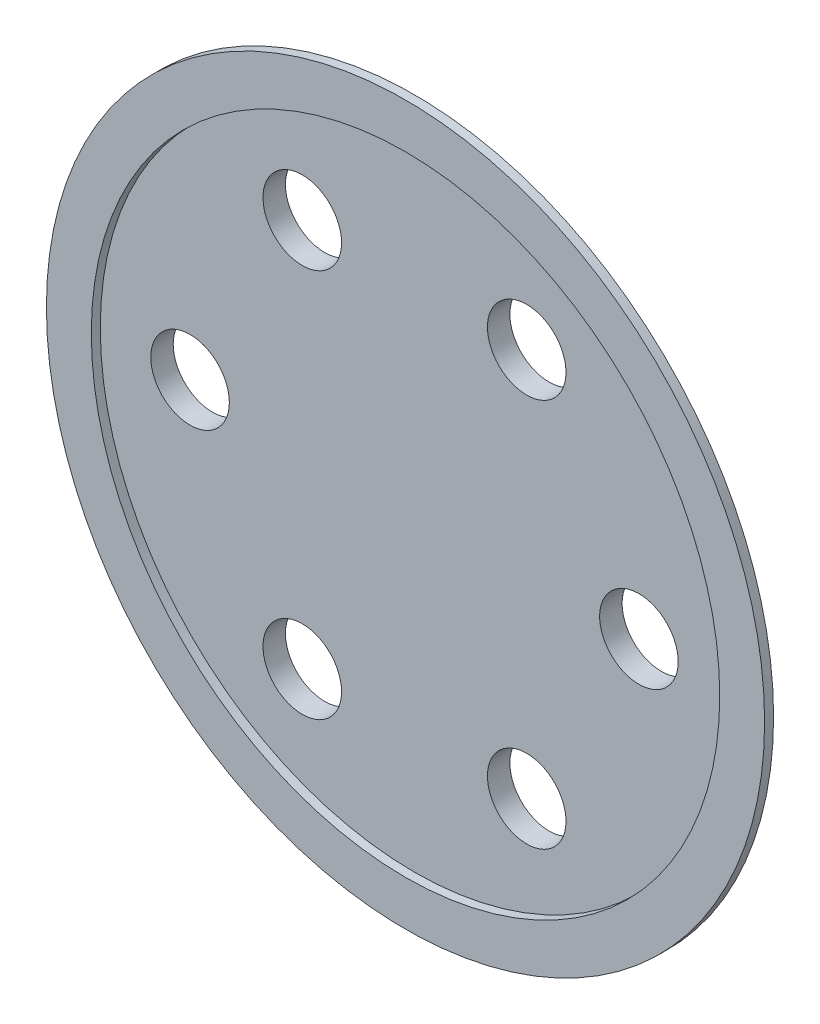
ISO-10303-21;
HEADER;
FILE_DESCRIPTION(('STEP AP214'),'2;1');
FILE_NAME('part.step','',(''),(''),'','','');
FILE_SCHEMA(('AUTOMOTIVE_DESIGN { 1 0 10303 214 1 1 1 1 }'));
ENDSEC;
DATA;
#1=APPLICATION_CONTEXT('core data for automotive mechanical design processes');
#2=APPLICATION_PROTOCOL_DEFINITION('international standard','automotive_design',2000,#1);
#3=PRODUCT_CONTEXT('',#1,'mechanical');
#4=PRODUCT('Part','Part','',(#3));
#5=PRODUCT_RELATED_PRODUCT_CATEGORY('part','',(#4));
#6=PRODUCT_DEFINITION_FORMATION('','',#4);
#7=PRODUCT_DEFINITION_CONTEXT('part definition',#1,'design');
#8=PRODUCT_DEFINITION('design','',#6,#7);
#9=PRODUCT_DEFINITION_SHAPE('','',#8);
#10=(LENGTH_UNIT() NAMED_UNIT(*) SI_UNIT(.MILLI.,.METRE.));
#11=(NAMED_UNIT(*) PLANE_ANGLE_UNIT() SI_UNIT($,.RADIAN.));
#12=(NAMED_UNIT(*) SI_UNIT($,.STERADIAN.) SOLID_ANGLE_UNIT());
#13=UNCERTAINTY_MEASURE_WITH_UNIT(LENGTH_MEASURE(1.E-05),#10,'distance_accuracy_value','');
#14=(GEOMETRIC_REPRESENTATION_CONTEXT(3) GLOBAL_UNCERTAINTY_ASSIGNED_CONTEXT((#13)) GLOBAL_UNIT_ASSIGNED_CONTEXT((#10,
#11,#12)) REPRESENTATION_CONTEXT('',''));
#15=CARTESIAN_POINT('',(0.,0.,0.));
#16=DIRECTION('',(0.,0.,1.));
#17=DIRECTION('',(1.,0.,0.));
#18=AXIS2_PLACEMENT_3D('',#15,#16,#17);
#19=CARTESIAN_POINT('',(0.,0.,-0.35));
#20=DIRECTION('',(0.,0.,1.));
#21=DIRECTION('',(1.,0.,0.));
#22=AXIS2_PLACEMENT_3D('',#19,#20,#21);
#23=CYLINDRICAL_SURFACE('',#22,4.9);
#24=CARTESIAN_POINT('',(0.,0.,-0.35));
#25=DIRECTION('',(0.,0.,-1.));
#26=DIRECTION('',(-1.,0.,0.));
#27=AXIS2_PLACEMENT_3D('',#24,#25,#26);
#28=CIRCLE('',#27,4.9);
#29=CARTESIAN_POINT('',(-4.9,0.,-0.35));
#30=VERTEX_POINT('',#29);
#31=EDGE_CURVE('E12',#30,#30,#28,.T.);
#32=ORIENTED_EDGE('',*,*,#31,.F.);
#33=EDGE_LOOP('',(#32));
#34=FACE_BOUND('',#33,.T.);
#35=CARTESIAN_POINT('',(0.,0.,0.));
#36=DIRECTION('',(0.,0.,-1.));
#37=DIRECTION('',(-1.,0.,0.));
#38=AXIS2_PLACEMENT_3D('',#35,#36,#37);
#39=CIRCLE('',#38,4.9);
#40=CARTESIAN_POINT('',(-4.9,0.,0.));
#41=VERTEX_POINT('',#40);
#42=EDGE_CURVE('E54',#41,#41,#39,.T.);
#43=ORIENTED_EDGE('',*,*,#42,.T.);
#44=EDGE_LOOP('',(#43));
#45=FACE_BOUND('',#44,.T.);
#46=ADVANCED_FACE('F51',(#34,#45),#23,.T.);
#47=CARTESIAN_POINT('',(0.,0.,-0.35));
#48=DIRECTION('',(0.,0.,-1.));
#49=DIRECTION('',(-1.,0.,0.));
#50=AXIS2_PLACEMENT_3D('',#47,#48,#49);
#51=PLANE('',#50);
#52=CARTESIAN_POINT('',(3.5,0.,-0.35));
#53=DIRECTION('',(0.,0.,-1.));
#54=DIRECTION('',(-1.,0.,0.));
#55=AXIS2_PLACEMENT_3D('',#52,#53,#54);
#56=CIRCLE('',#55,0.6125);
#57=CARTESIAN_POINT('',(2.8875,0.,-0.35));
#58=VERTEX_POINT('',#57);
#59=EDGE_CURVE('E61',#58,#58,#56,.F.);
#60=ORIENTED_EDGE('',*,*,#59,.T.);
#61=EDGE_LOOP('',(#60));
#62=FACE_BOUND('',#61,.T.);
#63=CARTESIAN_POINT('',(1.75,3.03108891324554,-0.35));
#64=DIRECTION('',(0.,0.,-1.));
#65=DIRECTION('',(-1.,0.,0.));
#66=AXIS2_PLACEMENT_3D('',#63,#64,#65);
#67=CIRCLE('',#66,0.612500000000002);
#68=CARTESIAN_POINT('',(1.1375,3.03108891324554,-0.35));
#69=VERTEX_POINT('',#68);
#70=EDGE_CURVE('E91',#69,#69,#67,.F.);
#71=ORIENTED_EDGE('',*,*,#70,.T.);
#72=EDGE_LOOP('',(#71));
#73=FACE_BOUND('',#72,.T.);
#74=CARTESIAN_POINT('',(-1.75,3.03108891324553,-0.35));
#75=DIRECTION('',(0.,0.,-1.));
#76=DIRECTION('',(-1.,0.,0.));
#77=AXIS2_PLACEMENT_3D('',#74,#75,#76);
#78=CIRCLE('',#77,0.612500000000001);
#79=CARTESIAN_POINT('',(-2.3625,3.03108891324553,-0.35));
#80=VERTEX_POINT('',#79);
#81=EDGE_CURVE('E67',#80,#80,#78,.F.);
#82=ORIENTED_EDGE('',*,*,#81,.T.);
#83=EDGE_LOOP('',(#82));
#84=FACE_BOUND('',#83,.T.);
#85=CARTESIAN_POINT('',(-3.5,0.,-0.35));
#86=DIRECTION('',(0.,0.,-1.));
#87=DIRECTION('',(-1.,0.,0.));
#88=AXIS2_PLACEMENT_3D('',#85,#86,#87);
#89=CIRCLE('',#88,0.6125);
#90=CARTESIAN_POINT('',(-4.1125,0.,-0.35));
#91=VERTEX_POINT('',#90);
#92=EDGE_CURVE('E66',#91,#91,#89,.F.);
#93=ORIENTED_EDGE('',*,*,#92,.T.);
#94=EDGE_LOOP('',(#93));
#95=FACE_BOUND('',#94,.T.);
#96=CARTESIAN_POINT('',(-1.75,-3.03108891324554,-0.35));
#97=DIRECTION('',(0.,0.,-1.));
#98=DIRECTION('',(-1.,0.,0.));
#99=AXIS2_PLACEMENT_3D('',#96,#97,#98);
#100=CIRCLE('',#99,0.6125);
#101=CARTESIAN_POINT('',(-2.3625,-3.03108891324554,-0.35));
#102=VERTEX_POINT('',#101);
#103=EDGE_CURVE('E74',#102,#102,#100,.F.);
#104=ORIENTED_EDGE('',*,*,#103,.T.);
#105=EDGE_LOOP('',(#104));
#106=FACE_BOUND('',#105,.T.);
#107=CARTESIAN_POINT('',(1.75,-3.03108891324554,-0.35));
#108=DIRECTION('',(0.,0.,-1.));
#109=DIRECTION('',(-1.,0.,0.));
#110=AXIS2_PLACEMENT_3D('',#107,#108,#109);
#111=CIRCLE('',#110,0.6125);
#112=CARTESIAN_POINT('',(1.1375,-3.03108891324554,-0.35));
#113=VERTEX_POINT('',#112);
#114=EDGE_CURVE('E80',#113,#113,#111,.F.);
#115=ORIENTED_EDGE('',*,*,#114,.T.);
#116=EDGE_LOOP('',(#115));
#117=FACE_BOUND('',#116,.T.);
#118=ORIENTED_EDGE('',*,*,#31,.T.);
#119=EDGE_LOOP('',(#118));
#120=FACE_BOUND('',#119,.T.);
#121=ADVANCED_FACE('F106',(#62,#73,#84,#95,#106,#117,#120),#51,.T.);
#122=CARTESIAN_POINT('',(0.,0.,0.));
#123=DIRECTION('',(0.,0.,-1.));
#124=DIRECTION('',(-1.,0.,0.));
#125=AXIS2_PLACEMENT_3D('',#122,#123,#124);
#126=PLANE('',#125);
#127=CARTESIAN_POINT('',(3.5,0.,0.));
#128=DIRECTION('',(0.,0.,1.));
#129=DIRECTION('',(1.,0.,0.));
#130=AXIS2_PLACEMENT_3D('',#127,#128,#129);
#131=CIRCLE('',#130,0.6125);
#132=CARTESIAN_POINT('',(4.1125,0.,0.));
#133=VERTEX_POINT('',#132);
#134=EDGE_CURVE('E86',#133,#133,#131,.T.);
#135=ORIENTED_EDGE('',*,*,#134,.F.);
#136=EDGE_LOOP('',(#135));
#137=FACE_BOUND('',#136,.T.);
#138=CARTESIAN_POINT('',(1.75,3.03108891324554,0.));
#139=DIRECTION('',(0.,0.,1.));
#140=DIRECTION('',(1.,0.,0.));
#141=AXIS2_PLACEMENT_3D('',#138,#139,#140);
#142=CIRCLE('',#141,0.612500000000002);
#143=CARTESIAN_POINT('',(2.3625,3.03108891324554,0.));
#144=VERTEX_POINT('',#143);
#145=EDGE_CURVE('E70',#144,#144,#142,.T.);
#146=ORIENTED_EDGE('',*,*,#145,.F.);
#147=EDGE_LOOP('',(#146));
#148=FACE_BOUND('',#147,.T.);
#149=CARTESIAN_POINT('',(-1.75,3.03108891324553,0.));
#150=DIRECTION('',(0.,0.,1.));
#151=DIRECTION('',(1.,0.,0.));
#152=AXIS2_PLACEMENT_3D('',#149,#150,#151);
#153=CIRCLE('',#152,0.612500000000001);
#154=CARTESIAN_POINT('',(-1.1375,3.03108891324553,0.));
#155=VERTEX_POINT('',#154);
#156=EDGE_CURVE('E63',#155,#155,#153,.T.);
#157=ORIENTED_EDGE('',*,*,#156,.F.);
#158=EDGE_LOOP('',(#157));
#159=FACE_BOUND('',#158,.T.);
#160=CARTESIAN_POINT('',(-3.5,0.,0.));
#161=DIRECTION('',(0.,0.,1.));
#162=DIRECTION('',(1.,0.,0.));
#163=AXIS2_PLACEMENT_3D('',#160,#161,#162);
#164=CIRCLE('',#163,0.6125);
#165=CARTESIAN_POINT('',(-2.8875,0.,0.));
#166=VERTEX_POINT('',#165);
#167=EDGE_CURVE('E71',#166,#166,#164,.T.);
#168=ORIENTED_EDGE('',*,*,#167,.F.);
#169=EDGE_LOOP('',(#168));
#170=FACE_BOUND('',#169,.T.);
#171=CARTESIAN_POINT('',(-1.75,-3.03108891324554,0.));
#172=DIRECTION('',(0.,0.,1.));
#173=DIRECTION('',(1.,0.,0.));
#174=AXIS2_PLACEMENT_3D('',#171,#172,#173);
#175=CIRCLE('',#174,0.6125);
#176=CARTESIAN_POINT('',(-1.1375,-3.03108891324554,0.));
#177=VERTEX_POINT('',#176);
#178=EDGE_CURVE('E77',#177,#177,#175,.T.);
#179=ORIENTED_EDGE('',*,*,#178,.F.);
#180=EDGE_LOOP('',(#179));
#181=FACE_BOUND('',#180,.T.);
#182=CARTESIAN_POINT('',(1.75,-3.03108891324554,0.));
#183=DIRECTION('',(0.,0.,1.));
#184=DIRECTION('',(1.,0.,0.));
#185=AXIS2_PLACEMENT_3D('',#182,#183,#184);
#186=CIRCLE('',#185,0.6125);
#187=CARTESIAN_POINT('',(2.3625,-3.03108891324554,0.));
#188=VERTEX_POINT('',#187);
#189=EDGE_CURVE('E83',#188,#188,#186,.T.);
#190=ORIENTED_EDGE('',*,*,#189,.F.);
#191=EDGE_LOOP('',(#190));
#192=FACE_BOUND('',#191,.T.);
#193=ORIENTED_EDGE('',*,*,#42,.F.);
#194=EDGE_LOOP('',(#193));
#195=FACE_BOUND('',#194,.T.);
#196=ADVANCED_FACE('F102',(#137,#148,#159,#170,#181,#192,#195),#126,.F.);
#197=CARTESIAN_POINT('',(1.75,-3.03108891324554,-2.08241161390705));
#198=DIRECTION('',(0.,0.,1.));
#199=DIRECTION('',(1.,0.,0.));
#200=AXIS2_PLACEMENT_3D('',#197,#198,#199);
#201=CYLINDRICAL_SURFACE('',#200,0.6125);
#202=ORIENTED_EDGE('',*,*,#189,.T.);
#203=EDGE_LOOP('',(#202));
#204=FACE_BOUND('',#203,.T.);
#205=ORIENTED_EDGE('',*,*,#114,.F.);
#206=EDGE_LOOP('',(#205));
#207=FACE_BOUND('',#206,.T.);
#208=ADVANCED_FACE('F105',(#204,#207),#201,.F.);
#209=CARTESIAN_POINT('',(-1.75,-3.03108891324554,-2.08241161390705));
#210=DIRECTION('',(0.,0.,1.));
#211=DIRECTION('',(1.,0.,0.));
#212=AXIS2_PLACEMENT_3D('',#209,#210,#211);
#213=CYLINDRICAL_SURFACE('',#212,0.6125);
#214=ORIENTED_EDGE('',*,*,#178,.T.);
#215=EDGE_LOOP('',(#214));
#216=FACE_BOUND('',#215,.T.);
#217=ORIENTED_EDGE('',*,*,#103,.F.);
#218=EDGE_LOOP('',(#217));
#219=FACE_BOUND('',#218,.T.);
#220=ADVANCED_FACE('F138',(#216,#219),#213,.F.);
#221=CARTESIAN_POINT('',(-3.5,0.,-2.08241161390705));
#222=DIRECTION('',(0.,0.,1.));
#223=DIRECTION('',(1.,0.,0.));
#224=AXIS2_PLACEMENT_3D('',#221,#222,#223);
#225=CYLINDRICAL_SURFACE('',#224,0.6125);
#226=ORIENTED_EDGE('',*,*,#167,.T.);
#227=EDGE_LOOP('',(#226));
#228=FACE_BOUND('',#227,.T.);
#229=ORIENTED_EDGE('',*,*,#92,.F.);
#230=EDGE_LOOP('',(#229));
#231=FACE_BOUND('',#230,.T.);
#232=ADVANCED_FACE('F134',(#228,#231),#225,.F.);
#233=CARTESIAN_POINT('',(-1.75,3.03108891324553,-2.08241161390705));
#234=DIRECTION('',(0.,0.,1.));
#235=DIRECTION('',(1.,0.,0.));
#236=AXIS2_PLACEMENT_3D('',#233,#234,#235);
#237=CYLINDRICAL_SURFACE('',#236,0.612500000000001);
#238=ORIENTED_EDGE('',*,*,#156,.T.);
#239=EDGE_LOOP('',(#238));
#240=FACE_BOUND('',#239,.T.);
#241=ORIENTED_EDGE('',*,*,#81,.F.);
#242=EDGE_LOOP('',(#241));
#243=FACE_BOUND('',#242,.T.);
#244=ADVANCED_FACE('F130',(#240,#243),#237,.F.);
#245=CARTESIAN_POINT('',(1.75,3.03108891324554,-2.08241161390705));
#246=DIRECTION('',(0.,0.,1.));
#247=DIRECTION('',(1.,0.,0.));
#248=AXIS2_PLACEMENT_3D('',#245,#246,#247);
#249=CYLINDRICAL_SURFACE('',#248,0.612500000000002);
#250=ORIENTED_EDGE('',*,*,#145,.T.);
#251=EDGE_LOOP('',(#250));
#252=FACE_BOUND('',#251,.T.);
#253=ORIENTED_EDGE('',*,*,#70,.F.);
#254=EDGE_LOOP('',(#253));
#255=FACE_BOUND('',#254,.T.);
#256=ADVANCED_FACE('F133',(#252,#255),#249,.F.);
#257=CARTESIAN_POINT('',(3.5,0.,-2.08241161390705));
#258=DIRECTION('',(0.,0.,1.));
#259=DIRECTION('',(1.,0.,0.));
#260=AXIS2_PLACEMENT_3D('',#257,#258,#259);
#261=CYLINDRICAL_SURFACE('',#260,0.6125);
#262=ORIENTED_EDGE('',*,*,#134,.T.);
#263=EDGE_LOOP('',(#262));
#264=FACE_BOUND('',#263,.T.);
#265=ORIENTED_EDGE('',*,*,#59,.F.);
#266=EDGE_LOOP('',(#265));
#267=FACE_BOUND('',#266,.T.);
#268=ADVANCED_FACE('F99',(#264,#267),#261,.F.);
#269=CLOSED_SHELL('',(#46,#121,#196,#208,#220,#232,#244,#256,#268));
#270=MANIFOLD_SOLID_BREP('B2',#269);
#271=CARTESIAN_POINT('',(0.,0.,0.14));
#272=DIRECTION('',(0.,0.,1.));
#273=DIRECTION('',(1.,0.,0.));
#274=AXIS2_PLACEMENT_3D('',#271,#272,#273);
#275=PLANE('',#274);
#276=CARTESIAN_POINT('',(0.,0.,0.14));
#277=DIRECTION('',(0.,0.,1.));
#278=DIRECTION('',(1.,0.,0.));
#279=AXIS2_PLACEMENT_3D('',#276,#277,#278);
#280=CIRCLE('',#279,5.6);
#281=CARTESIAN_POINT('',(5.6,0.,0.14));
#282=VERTEX_POINT('',#281);
#283=EDGE_CURVE('E50',#282,#282,#280,.T.);
#284=ORIENTED_EDGE('',*,*,#283,.T.);
#285=EDGE_LOOP('',(#284));
#286=FACE_BOUND('',#285,.T.);
#287=CARTESIAN_POINT('',(0.,0.,0.14));
#288=DIRECTION('',(0.,0.,1.));
#289=DIRECTION('',(1.,0.,0.));
#290=AXIS2_PLACEMENT_3D('',#287,#288,#289);
#291=CIRCLE('',#290,4.9);
#292=CARTESIAN_POINT('',(4.9,0.,0.14));
#293=VERTEX_POINT('',#292);
#294=EDGE_CURVE('E247',#293,#293,#291,.T.);
#295=ORIENTED_EDGE('',*,*,#294,.F.);
#296=EDGE_LOOP('',(#295));
#297=FACE_BOUND('',#296,.T.);
#298=ADVANCED_FACE('F236',(#286,#297),#275,.T.);
#299=CARTESIAN_POINT('',(0.,0.,0.));
#300=DIRECTION('',(0.,0.,1.));
#301=DIRECTION('',(1.,0.,0.));
#302=AXIS2_PLACEMENT_3D('',#299,#300,#301);
#303=PLANE('',#302);
#304=CARTESIAN_POINT('',(0.,0.,0.));
#305=DIRECTION('',(0.,0.,1.));
#306=DIRECTION('',(1.,0.,0.));
#307=AXIS2_PLACEMENT_3D('',#304,#305,#306);
#308=CIRCLE('',#307,5.6);
#309=CARTESIAN_POINT('',(5.6,0.,0.));
#310=VERTEX_POINT('',#309);
#311=EDGE_CURVE('E240',#310,#310,#308,.T.);
#312=ORIENTED_EDGE('',*,*,#311,.F.);
#313=EDGE_LOOP('',(#312));
#314=FACE_BOUND('',#313,.T.);
#315=CARTESIAN_POINT('',(0.,0.,0.));
#316=DIRECTION('',(0.,0.,1.));
#317=DIRECTION('',(1.,0.,0.));
#318=AXIS2_PLACEMENT_3D('',#315,#316,#317);
#319=CIRCLE('',#318,4.9);
#320=CARTESIAN_POINT('',(4.9,0.,0.));
#321=VERTEX_POINT('',#320);
#322=EDGE_CURVE('E249',#321,#321,#319,.T.);
#323=ORIENTED_EDGE('',*,*,#322,.T.);
#324=EDGE_LOOP('',(#323));
#325=FACE_BOUND('',#324,.T.);
#326=ADVANCED_FACE('F259',(#314,#325),#303,.F.);
#327=CARTESIAN_POINT('',(0.,0.,0.14));
#328=DIRECTION('',(0.,0.,-1.));
#329=DIRECTION('',(-1.,0.,0.));
#330=AXIS2_PLACEMENT_3D('',#327,#328,#329);
#331=CYLINDRICAL_SURFACE('',#330,5.6);
#332=ORIENTED_EDGE('',*,*,#283,.F.);
#333=EDGE_LOOP('',(#332));
#334=FACE_BOUND('',#333,.T.);
#335=ORIENTED_EDGE('',*,*,#311,.T.);
#336=EDGE_LOOP('',(#335));
#337=FACE_BOUND('',#336,.T.);
#338=ADVANCED_FACE('F238',(#334,#337),#331,.T.);
#339=CARTESIAN_POINT('',(0.,0.,0.14));
#340=DIRECTION('',(0.,0.,-1.));
#341=DIRECTION('',(-1.,0.,0.));
#342=AXIS2_PLACEMENT_3D('',#339,#340,#341);
#343=CYLINDRICAL_SURFACE('',#342,4.9);
#344=ORIENTED_EDGE('',*,*,#294,.T.);
#345=EDGE_LOOP('',(#344));
#346=FACE_BOUND('',#345,.T.);
#347=ORIENTED_EDGE('',*,*,#322,.F.);
#348=EDGE_LOOP('',(#347));
#349=FACE_BOUND('',#348,.T.);
#350=ADVANCED_FACE('F255',(#346,#349),#343,.F.);
#351=CLOSED_SHELL('',(#298,#326,#338,#350));
#352=MANIFOLD_SOLID_BREP('B7',#351);
#353=ADVANCED_BREP_SHAPE_REPRESENTATION('',(#18,#270,#352),#14);
#354=SHAPE_DEFINITION_REPRESENTATION(#9,#353);
ENDSEC;
END-ISO-10303-21;
